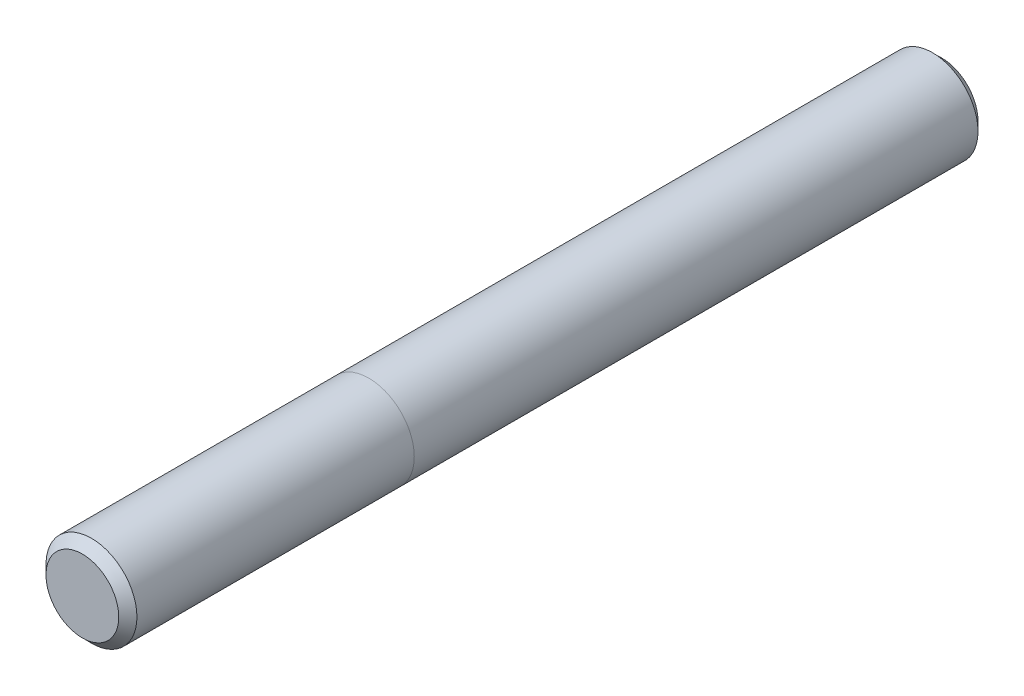
ISO-10303-21;
HEADER;
FILE_DESCRIPTION(('STEP AP214'),'2;1');
FILE_NAME('part.step','',(''),(''),'','','');
FILE_SCHEMA(('AUTOMOTIVE_DESIGN { 1 0 10303 214 1 1 1 1 }'));
ENDSEC;
DATA;
#1=APPLICATION_CONTEXT('core data for automotive mechanical design processes');
#2=APPLICATION_PROTOCOL_DEFINITION('international standard','automotive_design',2000,#1);
#3=PRODUCT_CONTEXT('',#1,'mechanical');
#4=PRODUCT('Part','Part','',(#3));
#5=PRODUCT_RELATED_PRODUCT_CATEGORY('part','',(#4));
#6=PRODUCT_DEFINITION_FORMATION('','',#4);
#7=PRODUCT_DEFINITION_CONTEXT('part definition',#1,'design');
#8=PRODUCT_DEFINITION('design','',#6,#7);
#9=PRODUCT_DEFINITION_SHAPE('','',#8);
#10=(LENGTH_UNIT() NAMED_UNIT(*) SI_UNIT(.MILLI.,.METRE.));
#11=(NAMED_UNIT(*) PLANE_ANGLE_UNIT() SI_UNIT($,.RADIAN.));
#12=(NAMED_UNIT(*) SI_UNIT($,.STERADIAN.) SOLID_ANGLE_UNIT());
#13=UNCERTAINTY_MEASURE_WITH_UNIT(LENGTH_MEASURE(1.E-05),#10,'distance_accuracy_value','');
#14=(GEOMETRIC_REPRESENTATION_CONTEXT(3) GLOBAL_UNCERTAINTY_ASSIGNED_CONTEXT((#13)) GLOBAL_UNIT_ASSIGNED_CONTEXT((#10,
#11,#12)) REPRESENTATION_CONTEXT('',''));
#15=CARTESIAN_POINT('',(0.,0.,0.));
#16=DIRECTION('',(0.,0.,1.));
#17=DIRECTION('',(1.,0.,0.));
#18=AXIS2_PLACEMENT_3D('',#15,#16,#17);
#19=CARTESIAN_POINT('',(0.,0.,75.));
#20=DIRECTION('',(0.,0.,-1.));
#21=DIRECTION('',(-1.,0.,0.));
#22=AXIS2_PLACEMENT_3D('',#19,#20,#21);
#23=CYLINDRICAL_SURFACE('',#22,7.9375);
#24=CARTESIAN_POINT('',(0.,0.,73.4125));
#25=DIRECTION('',(0.,0.,1.));
#26=DIRECTION('',(1.,0.,0.));
#27=AXIS2_PLACEMENT_3D('',#24,#25,#26);
#28=CIRCLE('',#27,7.9375);
#29=CARTESIAN_POINT('',(7.9375,0.,73.4125));
#30=VERTEX_POINT('',#29);
#31=EDGE_CURVE('E77',#30,#30,#28,.F.);
#32=ORIENTED_EDGE('',*,*,#31,.T.);
#33=EDGE_LOOP('',(#32));
#34=FACE_BOUND('',#33,.T.);
#35=CARTESIAN_POINT('',(0.,0.,25.));
#36=DIRECTION('',(0.,0.,-1.));
#37=DIRECTION('',(-1.,0.,0.));
#38=AXIS2_PLACEMENT_3D('',#35,#36,#37);
#39=CIRCLE('',#38,7.9375);
#40=CARTESIAN_POINT('',(-7.9375,0.,25.));
#41=VERTEX_POINT('',#40);
#42=CARTESIAN_POINT('',(7.9375,0.,25.));
#43=VERTEX_POINT('',#42);
#44=EDGE_CURVE('E11',#41,#43,#39,.T.);
#45=ORIENTED_EDGE('',*,*,#44,.F.);
#46=EDGE_CURVE('E49',#43,#41,#39,.T.);
#47=ORIENTED_EDGE('',*,*,#46,.F.);
#48=EDGE_LOOP('',(#45,#47));
#49=FACE_BOUND('',#48,.T.);
#50=ADVANCED_FACE('F45',(#34,#49),#23,.T.);
#51=ORIENTED_EDGE('',*,*,#46,.T.);
#52=ORIENTED_EDGE('',*,*,#44,.T.);
#53=EDGE_LOOP('',(#51,#52));
#54=FACE_BOUND('',#53,.T.);
#55=CARTESIAN_POINT('',(0.,0.,-73.4125));
#56=DIRECTION('',(0.,0.,1.));
#57=DIRECTION('',(1.,0.,0.));
#58=AXIS2_PLACEMENT_3D('',#55,#56,#57);
#59=CIRCLE('',#58,7.9375);
#60=CARTESIAN_POINT('',(7.9375,0.,-73.4125));
#61=VERTEX_POINT('',#60);
#62=EDGE_CURVE('E72',#61,#61,#59,.T.);
#63=ORIENTED_EDGE('',*,*,#62,.T.);
#64=EDGE_LOOP('',(#63));
#65=FACE_BOUND('',#64,.T.);
#66=ADVANCED_FACE('F61',(#54,#65),#23,.T.);
#67=CARTESIAN_POINT('',(0.,0.,75.));
#68=DIRECTION('',(0.,0.,1.));
#69=DIRECTION('',(1.,0.,0.));
#70=AXIS2_PLACEMENT_3D('',#67,#68,#69);
#71=PLANE('',#70);
#72=CARTESIAN_POINT('',(0.,0.,75.));
#73=DIRECTION('',(0.,0.,1.));
#74=DIRECTION('',(1.,0.,0.));
#75=AXIS2_PLACEMENT_3D('',#72,#73,#74);
#76=CIRCLE('',#75,6.34999999999997);
#77=CARTESIAN_POINT('',(6.34999999999997,0.,75.));
#78=VERTEX_POINT('',#77);
#79=EDGE_CURVE('E64',#78,#78,#76,.T.);
#80=ORIENTED_EDGE('',*,*,#79,.T.);
#81=EDGE_LOOP('',(#80));
#82=FACE_BOUND('',#81,.T.);
#83=ADVANCED_FACE('F95',(#82),#71,.T.);
#84=CARTESIAN_POINT('',(0.,0.,-75.));
#85=DIRECTION('',(0.,0.,1.));
#86=DIRECTION('',(1.,0.,0.));
#87=AXIS2_PLACEMENT_3D('',#84,#85,#86);
#88=PLANE('',#87);
#89=CARTESIAN_POINT('',(0.,0.,-75.));
#90=DIRECTION('',(0.,0.,1.));
#91=DIRECTION('',(1.,0.,0.));
#92=AXIS2_PLACEMENT_3D('',#89,#90,#91);
#93=CIRCLE('',#92,6.35000000000001);
#94=CARTESIAN_POINT('',(6.35000000000001,0.,-75.));
#95=VERTEX_POINT('',#94);
#96=EDGE_CURVE('E68',#95,#95,#93,.F.);
#97=ORIENTED_EDGE('',*,*,#96,.T.);
#98=EDGE_LOOP('',(#97));
#99=FACE_BOUND('',#98,.T.);
#100=ADVANCED_FACE('F89',(#99),#88,.F.);
#101=CARTESIAN_POINT('',(0.,0.,-73.4125));
#102=DIRECTION('',(0.,0.,1.));
#103=DIRECTION('',(1.,0.,0.));
#104=AXIS2_PLACEMENT_3D('',#101,#102,#103);
#105=CONICAL_SURFACE('',#104,7.9375,0.785398163397448);
#106=ORIENTED_EDGE('',*,*,#96,.F.);
#107=EDGE_LOOP('',(#106));
#108=FACE_BOUND('',#107,.T.);
#109=ORIENTED_EDGE('',*,*,#62,.F.);
#110=EDGE_LOOP('',(#109));
#111=FACE_BOUND('',#110,.T.);
#112=ADVANCED_FACE('F84',(#108,#111),#105,.T.);
#113=CARTESIAN_POINT('',(0.,0.,75.));
#114=DIRECTION('',(0.,0.,-1.));
#115=DIRECTION('',(-1.,0.,0.));
#116=AXIS2_PLACEMENT_3D('',#113,#114,#115);
#117=CONICAL_SURFACE('',#116,6.34999999999997,0.785398163397448);
#118=ORIENTED_EDGE('',*,*,#31,.F.);
#119=EDGE_LOOP('',(#118));
#120=FACE_BOUND('',#119,.T.);
#121=ORIENTED_EDGE('',*,*,#79,.F.);
#122=EDGE_LOOP('',(#121));
#123=FACE_BOUND('',#122,.T.);
#124=ADVANCED_FACE('F47',(#120,#123),#117,.T.);
#125=CLOSED_SHELL('',(#50,#66,#83,#100,#112,#124));
#126=MANIFOLD_SOLID_BREP('B2',#125);
#127=ADVANCED_BREP_SHAPE_REPRESENTATION('',(#18,#126),#14);
#128=SHAPE_DEFINITION_REPRESENTATION(#9,#127);
ENDSEC;
END-ISO-10303-21;
